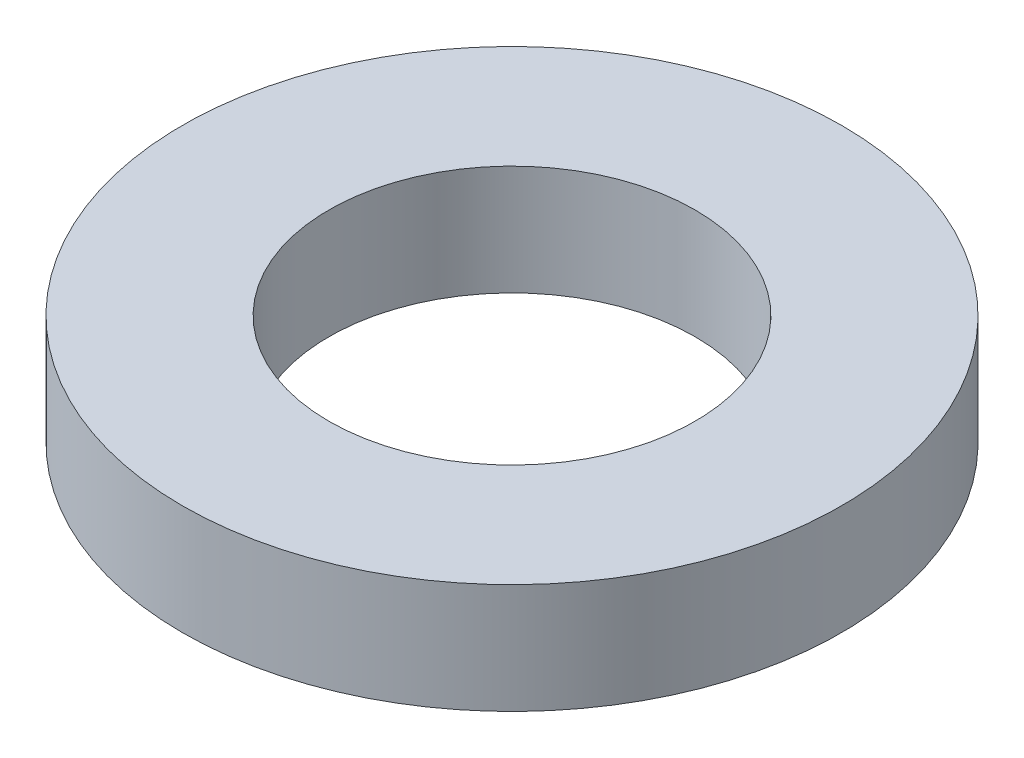
ISO-10303-21;
HEADER;
FILE_DESCRIPTION(('STEP AP214'),'2;1');
FILE_NAME('part.step','',(''),(''),'','','');
FILE_SCHEMA(('AUTOMOTIVE_DESIGN { 1 0 10303 214 1 1 1 1 }'));
ENDSEC;
DATA;
#1=APPLICATION_CONTEXT('core data for automotive mechanical design processes');
#2=APPLICATION_PROTOCOL_DEFINITION('international standard','automotive_design',2000,#1);
#3=PRODUCT_CONTEXT('',#1,'mechanical');
#4=PRODUCT('Part','Part','',(#3));
#5=PRODUCT_RELATED_PRODUCT_CATEGORY('part','',(#4));
#6=PRODUCT_DEFINITION_FORMATION('','',#4);
#7=PRODUCT_DEFINITION_CONTEXT('part definition',#1,'design');
#8=PRODUCT_DEFINITION('design','',#6,#7);
#9=PRODUCT_DEFINITION_SHAPE('','',#8);
#10=(LENGTH_UNIT() NAMED_UNIT(*) SI_UNIT(.MILLI.,.METRE.));
#11=(NAMED_UNIT(*) PLANE_ANGLE_UNIT() SI_UNIT($,.RADIAN.));
#12=(NAMED_UNIT(*) SI_UNIT($,.STERADIAN.) SOLID_ANGLE_UNIT());
#13=UNCERTAINTY_MEASURE_WITH_UNIT(LENGTH_MEASURE(1.E-05),#10,'distance_accuracy_value','');
#14=(GEOMETRIC_REPRESENTATION_CONTEXT(3) GLOBAL_UNCERTAINTY_ASSIGNED_CONTEXT((#13)) GLOBAL_UNIT_ASSIGNED_CONTEXT((#10,
#11,#12)) REPRESENTATION_CONTEXT('',''));
#15=CARTESIAN_POINT('',(0.,0.,0.));
#16=DIRECTION('',(0.,0.,1.));
#17=DIRECTION('',(1.,0.,0.));
#18=AXIS2_PLACEMENT_3D('',#15,#16,#17);
#19=CARTESIAN_POINT('',(0.,1.5,0.));
#20=DIRECTION('',(0.,1.,0.));
#21=DIRECTION('',(0.,0.,1.));
#22=AXIS2_PLACEMENT_3D('',#19,#20,#21);
#23=PLANE('',#22);
#24=CARTESIAN_POINT('',(0.,1.5,0.));
#25=DIRECTION('',(0.,1.,0.));
#26=DIRECTION('',(0.,0.,1.));
#27=AXIS2_PLACEMENT_3D('',#24,#25,#26);
#28=CIRCLE('',#27,4.5);
#29=CARTESIAN_POINT('',(0.,1.5,4.5));
#30=VERTEX_POINT('',#29);
#31=EDGE_CURVE('E10',#30,#30,#28,.T.);
#32=ORIENTED_EDGE('',*,*,#31,.T.);
#33=EDGE_LOOP('',(#32));
#34=FACE_BOUND('',#33,.T.);
#35=CARTESIAN_POINT('',(0.,1.5,0.));
#36=DIRECTION('',(0.,1.,0.));
#37=DIRECTION('',(0.,0.,1.));
#38=AXIS2_PLACEMENT_3D('',#35,#36,#37);
#39=CIRCLE('',#38,2.5);
#40=CARTESIAN_POINT('',(0.,1.5,2.5));
#41=VERTEX_POINT('',#40);
#42=EDGE_CURVE('E42',#41,#41,#39,.T.);
#43=ORIENTED_EDGE('',*,*,#42,.F.);
#44=EDGE_LOOP('',(#43));
#45=FACE_BOUND('',#44,.T.);
#46=ADVANCED_FACE('F31',(#34,#45),#23,.T.);
#47=CARTESIAN_POINT('',(0.,0.,0.));
#48=DIRECTION('',(0.,1.,0.));
#49=DIRECTION('',(0.,0.,1.));
#50=AXIS2_PLACEMENT_3D('',#47,#48,#49);
#51=PLANE('',#50);
#52=CARTESIAN_POINT('',(0.,0.,0.));
#53=DIRECTION('',(0.,1.,0.));
#54=DIRECTION('',(0.,0.,1.));
#55=AXIS2_PLACEMENT_3D('',#52,#53,#54);
#56=CIRCLE('',#55,4.5);
#57=CARTESIAN_POINT('',(0.,0.,4.5));
#58=VERTEX_POINT('',#57);
#59=EDGE_CURVE('E35',#58,#58,#56,.T.);
#60=ORIENTED_EDGE('',*,*,#59,.F.);
#61=EDGE_LOOP('',(#60));
#62=FACE_BOUND('',#61,.T.);
#63=CARTESIAN_POINT('',(0.,0.,0.));
#64=DIRECTION('',(0.,1.,0.));
#65=DIRECTION('',(0.,0.,1.));
#66=AXIS2_PLACEMENT_3D('',#63,#64,#65);
#67=CIRCLE('',#66,2.5);
#68=CARTESIAN_POINT('',(0.,0.,2.5));
#69=VERTEX_POINT('',#68);
#70=EDGE_CURVE('E44',#69,#69,#67,.T.);
#71=ORIENTED_EDGE('',*,*,#70,.T.);
#72=EDGE_LOOP('',(#71));
#73=FACE_BOUND('',#72,.T.);
#74=ADVANCED_FACE('F54',(#62,#73),#51,.F.);
#75=CARTESIAN_POINT('',(0.,1.5,0.));
#76=DIRECTION('',(0.,-1.,0.));
#77=DIRECTION('',(0.,0.,-1.));
#78=AXIS2_PLACEMENT_3D('',#75,#76,#77);
#79=CYLINDRICAL_SURFACE('',#78,4.5);
#80=ORIENTED_EDGE('',*,*,#31,.F.);
#81=EDGE_LOOP('',(#80));
#82=FACE_BOUND('',#81,.T.);
#83=ORIENTED_EDGE('',*,*,#59,.T.);
#84=EDGE_LOOP('',(#83));
#85=FACE_BOUND('',#84,.T.);
#86=ADVANCED_FACE('F33',(#82,#85),#79,.T.);
#87=CARTESIAN_POINT('',(0.,1.5,0.));
#88=DIRECTION('',(0.,-1.,0.));
#89=DIRECTION('',(0.,0.,-1.));
#90=AXIS2_PLACEMENT_3D('',#87,#88,#89);
#91=CYLINDRICAL_SURFACE('',#90,2.5);
#92=ORIENTED_EDGE('',*,*,#42,.T.);
#93=EDGE_LOOP('',(#92));
#94=FACE_BOUND('',#93,.T.);
#95=ORIENTED_EDGE('',*,*,#70,.F.);
#96=EDGE_LOOP('',(#95));
#97=FACE_BOUND('',#96,.T.);
#98=ADVANCED_FACE('F50',(#94,#97),#91,.F.);
#99=CLOSED_SHELL('',(#46,#74,#86,#98));
#100=MANIFOLD_SOLID_BREP('B2',#99);
#101=ADVANCED_BREP_SHAPE_REPRESENTATION('',(#18,#100),#14);
#102=SHAPE_DEFINITION_REPRESENTATION(#9,#101);
ENDSEC;
END-ISO-10303-21;
